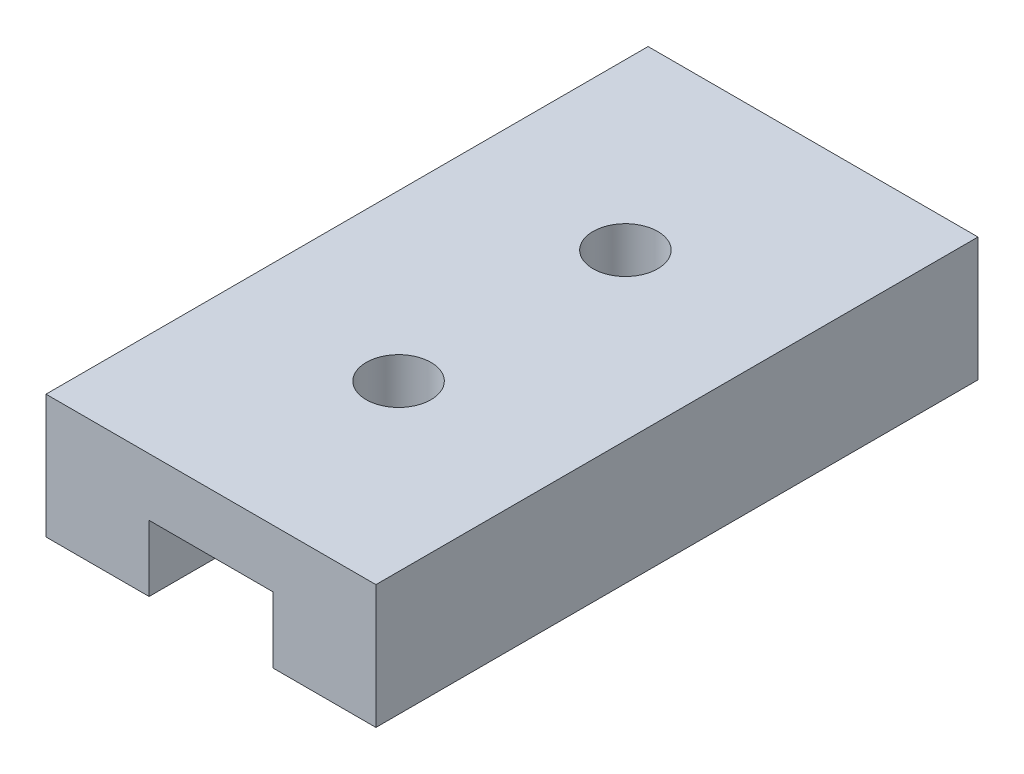
ISO-10303-21;
HEADER;
FILE_DESCRIPTION(('STEP AP214'),'2;1');
FILE_NAME('part.step','',(''),(''),'','','');
FILE_SCHEMA(('AUTOMOTIVE_DESIGN { 1 0 10303 214 1 1 1 1 }'));
ENDSEC;
DATA;
#1=APPLICATION_CONTEXT('core data for automotive mechanical design processes');
#2=APPLICATION_PROTOCOL_DEFINITION('international standard','automotive_design',2000,#1);
#3=PRODUCT_CONTEXT('',#1,'mechanical');
#4=PRODUCT('Part','Part','',(#3));
#5=PRODUCT_RELATED_PRODUCT_CATEGORY('part','',(#4));
#6=PRODUCT_DEFINITION_FORMATION('','',#4);
#7=PRODUCT_DEFINITION_CONTEXT('part definition',#1,'design');
#8=PRODUCT_DEFINITION('design','',#6,#7);
#9=PRODUCT_DEFINITION_SHAPE('','',#8);
#10=(LENGTH_UNIT() NAMED_UNIT(*) SI_UNIT(.MILLI.,.METRE.));
#11=(NAMED_UNIT(*) PLANE_ANGLE_UNIT() SI_UNIT($,.RADIAN.));
#12=(NAMED_UNIT(*) SI_UNIT($,.STERADIAN.) SOLID_ANGLE_UNIT());
#13=UNCERTAINTY_MEASURE_WITH_UNIT(LENGTH_MEASURE(1.E-05),#10,'distance_accuracy_value','');
#14=(GEOMETRIC_REPRESENTATION_CONTEXT(3) GLOBAL_UNCERTAINTY_ASSIGNED_CONTEXT((#13)) GLOBAL_UNIT_ASSIGNED_CONTEXT((#10,
#11,#12)) REPRESENTATION_CONTEXT('',''));
#15=CARTESIAN_POINT('',(0.,0.,0.));
#16=DIRECTION('',(0.,0.,1.));
#17=DIRECTION('',(1.,0.,0.));
#18=AXIS2_PLACEMENT_3D('',#15,#16,#17);
#19=CARTESIAN_POINT('',(-1.5,1.6,14.6));
#20=DIRECTION('',(-1.,0.,0.));
#21=DIRECTION('',(0.,-1.,0.));
#22=AXIS2_PLACEMENT_3D('',#19,#20,#21);
#23=PLANE('',#22);
#24=DIRECTION('',(0.,1.,0.));
#25=VECTOR('',#24,1.);
#26=CARTESIAN_POINT('',(-1.5,1.6,0.));
#27=LINE('',#26,#25);
#28=CARTESIAN_POINT('',(-1.5,0.,0.));
#29=VERTEX_POINT('',#28);
#30=CARTESIAN_POINT('',(-1.5,1.6,0.));
#31=VERTEX_POINT('',#30);
#32=EDGE_CURVE('E129',#29,#31,#27,.T.);
#33=ORIENTED_EDGE('',*,*,#32,.T.);
#34=DIRECTION('',(0.,0.,-1.));
#35=VECTOR('',#34,1.);
#36=CARTESIAN_POINT('',(-1.5,1.6,14.6));
#37=LINE('',#36,#35);
#38=CARTESIAN_POINT('',(-1.5,1.6,14.6));
#39=VERTEX_POINT('',#38);
#40=EDGE_CURVE('E11',#39,#31,#37,.T.);
#41=ORIENTED_EDGE('',*,*,#40,.F.);
#42=DIRECTION('',(0.,1.,0.));
#43=VECTOR('',#42,1.);
#44=CARTESIAN_POINT('',(-1.5,1.6,14.6));
#45=LINE('',#44,#43);
#46=CARTESIAN_POINT('',(-1.5,0.,14.6));
#47=VERTEX_POINT('',#46);
#48=EDGE_CURVE('E144',#47,#39,#45,.T.);
#49=ORIENTED_EDGE('',*,*,#48,.F.);
#50=DIRECTION('',(0.,0.,-1.));
#51=VECTOR('',#50,1.);
#52=CARTESIAN_POINT('',(-1.5,0.,14.6));
#53=LINE('',#52,#51);
#54=EDGE_CURVE('E125',#47,#29,#53,.T.);
#55=ORIENTED_EDGE('',*,*,#54,.T.);
#56=EDGE_LOOP('',(#33,#41,#49,#55));
#57=FACE_BOUND('',#56,.T.);
#58=ADVANCED_FACE('F33',(#57),#23,.F.);
#59=CARTESIAN_POINT('',(1.5,1.6,14.6));
#60=DIRECTION('',(0.,1.,0.));
#61=DIRECTION('',(0.,0.,1.));
#62=AXIS2_PLACEMENT_3D('',#59,#60,#61);
#63=PLANE('',#62);
#64=CARTESIAN_POINT('',(0.,1.6,10.05));
#65=DIRECTION('',(0.,1.,0.));
#66=DIRECTION('',(0.,0.,1.));
#67=AXIS2_PLACEMENT_3D('',#64,#65,#66);
#68=CIRCLE('',#67,0.785);
#69=CARTESIAN_POINT('',(0.,1.6,10.835));
#70=VERTEX_POINT('',#69);
#71=EDGE_CURVE('E133',#70,#70,#68,.T.);
#72=ORIENTED_EDGE('',*,*,#71,.T.);
#73=EDGE_LOOP('',(#72));
#74=FACE_BOUND('',#73,.T.);
#75=CARTESIAN_POINT('',(0.,1.6,4.55));
#76=DIRECTION('',(0.,1.,0.));
#77=DIRECTION('',(0.,0.,1.));
#78=AXIS2_PLACEMENT_3D('',#75,#76,#77);
#79=CIRCLE('',#78,0.785);
#80=CARTESIAN_POINT('',(0.,1.6,5.335));
#81=VERTEX_POINT('',#80);
#82=EDGE_CURVE('E179',#81,#81,#79,.T.);
#83=ORIENTED_EDGE('',*,*,#82,.T.);
#84=EDGE_LOOP('',(#83));
#85=FACE_BOUND('',#84,.T.);
#86=DIRECTION('',(1.,0.,0.));
#87=VECTOR('',#86,1.);
#88=CARTESIAN_POINT('',(1.5,1.6,0.));
#89=LINE('',#88,#87);
#90=CARTESIAN_POINT('',(1.5,1.6,0.));
#91=VERTEX_POINT('',#90);
#92=EDGE_CURVE('E132',#31,#91,#89,.T.);
#93=ORIENTED_EDGE('',*,*,#92,.T.);
#94=DIRECTION('',(0.,0.,-1.));
#95=VECTOR('',#94,1.);
#96=CARTESIAN_POINT('',(1.5,1.6,14.6));
#97=LINE('',#96,#95);
#98=CARTESIAN_POINT('',(1.5,1.6,14.6));
#99=VERTEX_POINT('',#98);
#100=EDGE_CURVE('E41',#99,#91,#97,.T.);
#101=ORIENTED_EDGE('',*,*,#100,.F.);
#102=DIRECTION('',(1.,0.,0.));
#103=VECTOR('',#102,1.);
#104=CARTESIAN_POINT('',(1.5,1.6,14.6));
#105=LINE('',#104,#103);
#106=EDGE_CURVE('E92',#39,#99,#105,.T.);
#107=ORIENTED_EDGE('',*,*,#106,.F.);
#108=ORIENTED_EDGE('',*,*,#40,.T.);
#109=EDGE_LOOP('',(#93,#101,#107,#108));
#110=FACE_BOUND('',#109,.T.);
#111=ADVANCED_FACE('F203',(#74,#85,#110),#63,.F.);
#112=CARTESIAN_POINT('',(1.5,0.,14.6));
#113=DIRECTION('',(1.,0.,0.));
#114=DIRECTION('',(0.,1.,0.));
#115=AXIS2_PLACEMENT_3D('',#112,#113,#114);
#116=PLANE('',#115);
#117=DIRECTION('',(0.,-1.,0.));
#118=VECTOR('',#117,1.);
#119=CARTESIAN_POINT('',(1.5,0.,0.));
#120=LINE('',#119,#118);
#121=CARTESIAN_POINT('',(1.5,0.,0.));
#122=VERTEX_POINT('',#121);
#123=EDGE_CURVE('E135',#91,#122,#120,.T.);
#124=ORIENTED_EDGE('',*,*,#123,.T.);
#125=DIRECTION('',(0.,0.,-1.));
#126=VECTOR('',#125,1.);
#127=CARTESIAN_POINT('',(1.5,0.,14.6));
#128=LINE('',#127,#126);
#129=CARTESIAN_POINT('',(1.5,0.,14.6));
#130=VERTEX_POINT('',#129);
#131=EDGE_CURVE('E151',#130,#122,#128,.T.);
#132=ORIENTED_EDGE('',*,*,#131,.F.);
#133=DIRECTION('',(0.,-1.,0.));
#134=VECTOR('',#133,1.);
#135=CARTESIAN_POINT('',(1.5,0.,14.6));
#136=LINE('',#135,#134);
#137=EDGE_CURVE('E159',#99,#130,#136,.T.);
#138=ORIENTED_EDGE('',*,*,#137,.F.);
#139=ORIENTED_EDGE('',*,*,#100,.T.);
#140=EDGE_LOOP('',(#124,#132,#138,#139));
#141=FACE_BOUND('',#140,.T.);
#142=ADVANCED_FACE('F157',(#141),#116,.F.);
#143=CARTESIAN_POINT('',(4.,0.,14.6));
#144=DIRECTION('',(0.,1.,0.));
#145=DIRECTION('',(-1.,0.,0.));
#146=AXIS2_PLACEMENT_3D('',#143,#144,#145);
#147=PLANE('',#146);
#148=DIRECTION('',(1.,0.,0.));
#149=VECTOR('',#148,1.);
#150=CARTESIAN_POINT('',(4.,0.,0.));
#151=LINE('',#150,#149);
#152=CARTESIAN_POINT('',(4.,0.,0.));
#153=VERTEX_POINT('',#152);
#154=EDGE_CURVE('E137',#122,#153,#151,.T.);
#155=ORIENTED_EDGE('',*,*,#154,.T.);
#156=DIRECTION('',(0.,0.,-1.));
#157=VECTOR('',#156,1.);
#158=CARTESIAN_POINT('',(4.,0.,14.6));
#159=LINE('',#158,#157);
#160=CARTESIAN_POINT('',(4.,0.,14.6));
#161=VERTEX_POINT('',#160);
#162=EDGE_CURVE('E148',#161,#153,#159,.T.);
#163=ORIENTED_EDGE('',*,*,#162,.F.);
#164=DIRECTION('',(1.,0.,0.));
#165=VECTOR('',#164,1.);
#166=CARTESIAN_POINT('',(4.,0.,14.6));
#167=LINE('',#166,#165);
#168=EDGE_CURVE('E171',#130,#161,#167,.T.);
#169=ORIENTED_EDGE('',*,*,#168,.F.);
#170=ORIENTED_EDGE('',*,*,#131,.T.);
#171=EDGE_LOOP('',(#155,#163,#169,#170));
#172=FACE_BOUND('',#171,.T.);
#173=ADVANCED_FACE('F167',(#172),#147,.F.);
#174=CARTESIAN_POINT('',(4.,3.,14.6));
#175=DIRECTION('',(-1.,0.,0.));
#176=DIRECTION('',(0.,0.,1.));
#177=AXIS2_PLACEMENT_3D('',#174,#175,#176);
#178=PLANE('',#177);
#179=DIRECTION('',(0.,1.,0.));
#180=VECTOR('',#179,1.);
#181=CARTESIAN_POINT('',(4.,3.,0.));
#182=LINE('',#181,#180);
#183=CARTESIAN_POINT('',(4.,3.,0.));
#184=VERTEX_POINT('',#183);
#185=EDGE_CURVE('E139',#153,#184,#182,.T.);
#186=ORIENTED_EDGE('',*,*,#185,.T.);
#187=DIRECTION('',(0.,0.,-1.));
#188=VECTOR('',#187,1.);
#189=CARTESIAN_POINT('',(4.,3.,14.6));
#190=LINE('',#189,#188);
#191=CARTESIAN_POINT('',(4.,3.,14.6));
#192=VERTEX_POINT('',#191);
#193=EDGE_CURVE('E120',#192,#184,#190,.T.);
#194=ORIENTED_EDGE('',*,*,#193,.F.);
#195=DIRECTION('',(0.,1.,0.));
#196=VECTOR('',#195,1.);
#197=CARTESIAN_POINT('',(4.,3.,14.6));
#198=LINE('',#197,#196);
#199=EDGE_CURVE('E111',#161,#192,#198,.T.);
#200=ORIENTED_EDGE('',*,*,#199,.F.);
#201=ORIENTED_EDGE('',*,*,#162,.T.);
#202=EDGE_LOOP('',(#186,#194,#200,#201));
#203=FACE_BOUND('',#202,.T.);
#204=ADVANCED_FACE('F170',(#203),#178,.F.);
#205=CARTESIAN_POINT('',(-4.,3.,14.6));
#206=DIRECTION('',(0.,-1.,0.));
#207=DIRECTION('',(1.,0.,0.));
#208=AXIS2_PLACEMENT_3D('',#205,#206,#207);
#209=PLANE('',#208);
#210=CARTESIAN_POINT('',(0.,3.,10.05));
#211=DIRECTION('',(0.,1.,0.));
#212=DIRECTION('',(-1.,0.,0.));
#213=AXIS2_PLACEMENT_3D('',#210,#211,#212);
#214=CIRCLE('',#213,0.785);
#215=CARTESIAN_POINT('',(-0.784999999999999,3.,10.05));
#216=VERTEX_POINT('',#215);
#217=EDGE_CURVE('E182',#216,#216,#214,.T.);
#218=ORIENTED_EDGE('',*,*,#217,.F.);
#219=EDGE_LOOP('',(#218));
#220=FACE_BOUND('',#219,.T.);
#221=CARTESIAN_POINT('',(0.,3.,4.55));
#222=DIRECTION('',(0.,1.,0.));
#223=DIRECTION('',(-1.,0.,0.));
#224=AXIS2_PLACEMENT_3D('',#221,#222,#223);
#225=CIRCLE('',#224,0.785);
#226=CARTESIAN_POINT('',(-0.784999999999999,3.,4.55));
#227=VERTEX_POINT('',#226);
#228=EDGE_CURVE('E183',#227,#227,#225,.T.);
#229=ORIENTED_EDGE('',*,*,#228,.F.);
#230=EDGE_LOOP('',(#229));
#231=FACE_BOUND('',#230,.T.);
#232=DIRECTION('',(-1.,0.,0.));
#233=VECTOR('',#232,1.);
#234=CARTESIAN_POINT('',(-4.,3.,0.));
#235=LINE('',#234,#233);
#236=CARTESIAN_POINT('',(-4.,3.,0.));
#237=VERTEX_POINT('',#236);
#238=EDGE_CURVE('E119',#184,#237,#235,.T.);
#239=ORIENTED_EDGE('',*,*,#238,.T.);
#240=DIRECTION('',(0.,0.,-1.));
#241=VECTOR('',#240,1.);
#242=CARTESIAN_POINT('',(-4.,3.,14.6));
#243=LINE('',#242,#241);
#244=CARTESIAN_POINT('',(-4.,3.,14.6));
#245=VERTEX_POINT('',#244);
#246=EDGE_CURVE('E116',#245,#237,#243,.T.);
#247=ORIENTED_EDGE('',*,*,#246,.F.);
#248=DIRECTION('',(-1.,0.,0.));
#249=VECTOR('',#248,1.);
#250=CARTESIAN_POINT('',(-4.,3.,14.6));
#251=LINE('',#250,#249);
#252=EDGE_CURVE('E105',#192,#245,#251,.T.);
#253=ORIENTED_EDGE('',*,*,#252,.F.);
#254=ORIENTED_EDGE('',*,*,#193,.T.);
#255=EDGE_LOOP('',(#239,#247,#253,#254));
#256=FACE_BOUND('',#255,.T.);
#257=ADVANCED_FACE('F117',(#220,#231,#256),#209,.F.);
#258=CARTESIAN_POINT('',(-4.,0.,14.6));
#259=DIRECTION('',(1.,0.,0.));
#260=DIRECTION('',(0.,0.,-1.));
#261=AXIS2_PLACEMENT_3D('',#258,#259,#260);
#262=PLANE('',#261);
#263=DIRECTION('',(0.,-1.,0.));
#264=VECTOR('',#263,1.);
#265=CARTESIAN_POINT('',(-4.,0.,0.));
#266=LINE('',#265,#264);
#267=CARTESIAN_POINT('',(-4.,0.,0.));
#268=VERTEX_POINT('',#267);
#269=EDGE_CURVE('E78',#237,#268,#266,.T.);
#270=ORIENTED_EDGE('',*,*,#269,.T.);
#271=DIRECTION('',(0.,0.,-1.));
#272=VECTOR('',#271,1.);
#273=CARTESIAN_POINT('',(-4.,0.,14.6));
#274=LINE('',#273,#272);
#275=CARTESIAN_POINT('',(-4.,0.,14.6));
#276=VERTEX_POINT('',#275);
#277=EDGE_CURVE('E121',#276,#268,#274,.T.);
#278=ORIENTED_EDGE('',*,*,#277,.F.);
#279=DIRECTION('',(0.,-1.,0.));
#280=VECTOR('',#279,1.);
#281=CARTESIAN_POINT('',(-4.,0.,14.6));
#282=LINE('',#281,#280);
#283=EDGE_CURVE('E109',#245,#276,#282,.T.);
#284=ORIENTED_EDGE('',*,*,#283,.F.);
#285=ORIENTED_EDGE('',*,*,#246,.T.);
#286=EDGE_LOOP('',(#270,#278,#284,#285));
#287=FACE_BOUND('',#286,.T.);
#288=ADVANCED_FACE('F123',(#287),#262,.F.);
#289=CARTESIAN_POINT('',(-1.5,0.,14.6));
#290=DIRECTION('',(0.,1.,0.));
#291=DIRECTION('',(-1.,0.,0.));
#292=AXIS2_PLACEMENT_3D('',#289,#290,#291);
#293=PLANE('',#292);
#294=DIRECTION('',(1.,0.,0.));
#295=VECTOR('',#294,1.);
#296=CARTESIAN_POINT('',(-1.5,0.,0.));
#297=LINE('',#296,#295);
#298=EDGE_CURVE('E84',#268,#29,#297,.T.);
#299=ORIENTED_EDGE('',*,*,#298,.T.);
#300=ORIENTED_EDGE('',*,*,#54,.F.);
#301=DIRECTION('',(1.,0.,0.));
#302=VECTOR('',#301,1.);
#303=CARTESIAN_POINT('',(-1.5,0.,14.6));
#304=LINE('',#303,#302);
#305=EDGE_CURVE('E49',#276,#47,#304,.T.);
#306=ORIENTED_EDGE('',*,*,#305,.F.);
#307=ORIENTED_EDGE('',*,*,#277,.T.);
#308=EDGE_LOOP('',(#299,#300,#306,#307));
#309=FACE_BOUND('',#308,.T.);
#310=ADVANCED_FACE('F209',(#309),#293,.F.);
#311=CARTESIAN_POINT('',(0.,0.,14.6));
#312=DIRECTION('',(0.,0.,-1.));
#313=DIRECTION('',(-1.,0.,0.));
#314=AXIS2_PLACEMENT_3D('',#311,#312,#313);
#315=PLANE('',#314);
#316=ORIENTED_EDGE('',*,*,#48,.T.);
#317=ORIENTED_EDGE('',*,*,#106,.T.);
#318=ORIENTED_EDGE('',*,*,#137,.T.);
#319=ORIENTED_EDGE('',*,*,#168,.T.);
#320=ORIENTED_EDGE('',*,*,#199,.T.);
#321=ORIENTED_EDGE('',*,*,#252,.T.);
#322=ORIENTED_EDGE('',*,*,#283,.T.);
#323=ORIENTED_EDGE('',*,*,#305,.T.);
#324=EDGE_LOOP('',(#316,#317,#318,#319,#320,#321,#322,#323));
#325=FACE_BOUND('',#324,.T.);
#326=ADVANCED_FACE('F107',(#325),#315,.F.);
#327=CARTESIAN_POINT('',(0.,0.,0.));
#328=DIRECTION('',(0.,0.,-1.));
#329=DIRECTION('',(-1.,0.,0.));
#330=AXIS2_PLACEMENT_3D('',#327,#328,#329);
#331=PLANE('',#330);
#332=ORIENTED_EDGE('',*,*,#32,.F.);
#333=ORIENTED_EDGE('',*,*,#298,.F.);
#334=ORIENTED_EDGE('',*,*,#269,.F.);
#335=ORIENTED_EDGE('',*,*,#238,.F.);
#336=ORIENTED_EDGE('',*,*,#185,.F.);
#337=ORIENTED_EDGE('',*,*,#154,.F.);
#338=ORIENTED_EDGE('',*,*,#123,.F.);
#339=ORIENTED_EDGE('',*,*,#92,.F.);
#340=EDGE_LOOP('',(#332,#333,#334,#335,#336,#337,#338,#339));
#341=FACE_BOUND('',#340,.T.);
#342=ADVANCED_FACE('F163',(#341),#331,.T.);
#343=CARTESIAN_POINT('',(0.,0.,4.55));
#344=DIRECTION('',(0.,1.,0.));
#345=DIRECTION('',(-1.,0.,0.));
#346=AXIS2_PLACEMENT_3D('',#343,#344,#345);
#347=CYLINDRICAL_SURFACE('',#346,0.785);
#348=ORIENTED_EDGE('',*,*,#228,.T.);
#349=EDGE_LOOP('',(#348));
#350=FACE_BOUND('',#349,.T.);
#351=ORIENTED_EDGE('',*,*,#82,.F.);
#352=EDGE_LOOP('',(#351));
#353=FACE_BOUND('',#352,.T.);
#354=ADVANCED_FACE('F197',(#350,#353),#347,.F.);
#355=CARTESIAN_POINT('',(0.,0.,10.05));
#356=DIRECTION('',(0.,1.,0.));
#357=DIRECTION('',(-1.,0.,0.));
#358=AXIS2_PLACEMENT_3D('',#355,#356,#357);
#359=CYLINDRICAL_SURFACE('',#358,0.785);
#360=ORIENTED_EDGE('',*,*,#217,.T.);
#361=EDGE_LOOP('',(#360));
#362=FACE_BOUND('',#361,.T.);
#363=ORIENTED_EDGE('',*,*,#71,.F.);
#364=EDGE_LOOP('',(#363));
#365=FACE_BOUND('',#364,.T.);
#366=ADVANCED_FACE('F189',(#362,#365),#359,.F.);
#367=CLOSED_SHELL('',(#58,#111,#142,#173,#204,#257,#288,#310,#326,#342,#354,#366));
#368=MANIFOLD_SOLID_BREP('B2',#367);
#369=ADVANCED_BREP_SHAPE_REPRESENTATION('',(#18,#368),#14);
#370=SHAPE_DEFINITION_REPRESENTATION(#9,#369);
ENDSEC;
END-ISO-10303-21;
